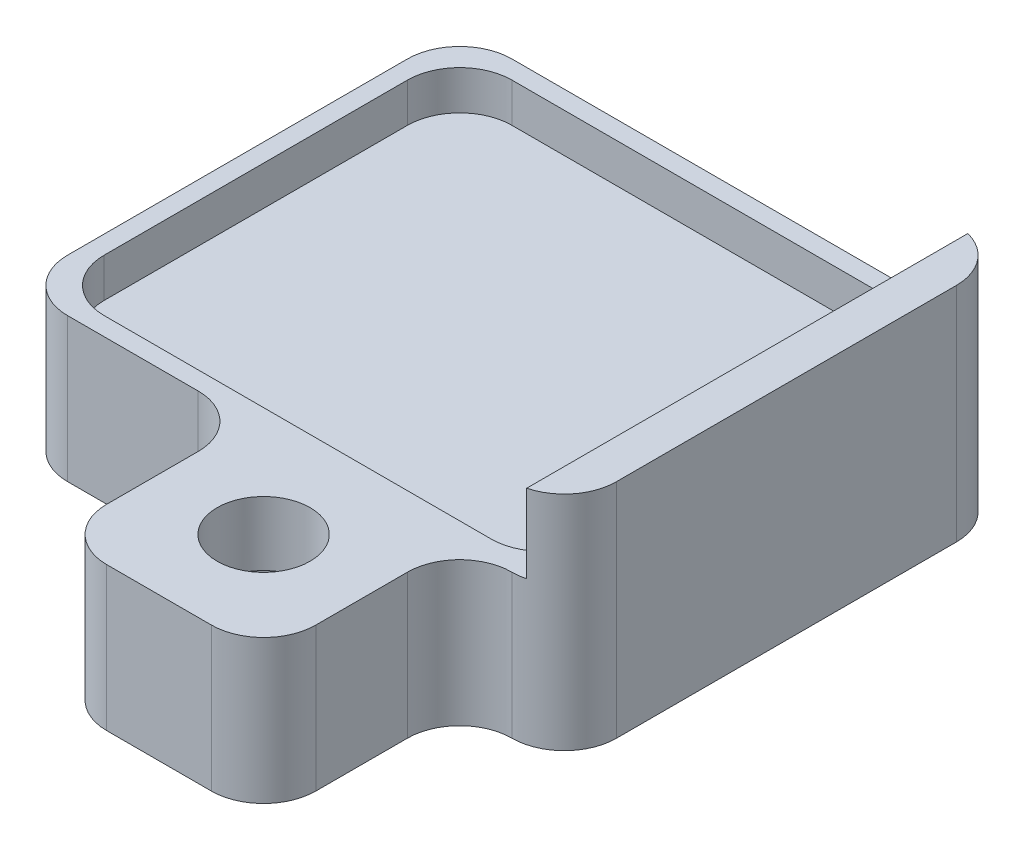
ISO-10303-21;
HEADER;
FILE_DESCRIPTION(('STEP AP214'),'2;1');
FILE_NAME('part.step','',(''),(''),'','','');
FILE_SCHEMA(('AUTOMOTIVE_DESIGN { 1 0 10303 214 1 1 1 1 }'));
ENDSEC;
DATA;
#1=APPLICATION_CONTEXT('core data for automotive mechanical design processes');
#2=APPLICATION_PROTOCOL_DEFINITION('international standard','automotive_design',2000,#1);
#3=PRODUCT_CONTEXT('',#1,'mechanical');
#4=PRODUCT('Part','Part','',(#3));
#5=PRODUCT_RELATED_PRODUCT_CATEGORY('part','',(#4));
#6=PRODUCT_DEFINITION_FORMATION('','',#4);
#7=PRODUCT_DEFINITION_CONTEXT('part definition',#1,'design');
#8=PRODUCT_DEFINITION('design','',#6,#7);
#9=PRODUCT_DEFINITION_SHAPE('','',#8);
#10=(LENGTH_UNIT() NAMED_UNIT(*) SI_UNIT(.MILLI.,.METRE.));
#11=(NAMED_UNIT(*) PLANE_ANGLE_UNIT() SI_UNIT($,.RADIAN.));
#12=(NAMED_UNIT(*) SI_UNIT($,.STERADIAN.) SOLID_ANGLE_UNIT());
#13=UNCERTAINTY_MEASURE_WITH_UNIT(LENGTH_MEASURE(1.E-05),#10,'distance_accuracy_value','');
#14=(GEOMETRIC_REPRESENTATION_CONTEXT(3) GLOBAL_UNCERTAINTY_ASSIGNED_CONTEXT((#13)) GLOBAL_UNIT_ASSIGNED_CONTEXT((#10,
#11,#12)) REPRESENTATION_CONTEXT('',''));
#15=CARTESIAN_POINT('',(0.,0.,0.));
#16=DIRECTION('',(0.,0.,1.));
#17=DIRECTION('',(1.,0.,0.));
#18=AXIS2_PLACEMENT_3D('',#15,#16,#17);
#19=CARTESIAN_POINT('',(-5.25,4.25,4.25));
#20=DIRECTION('',(0.,0.,-1.));
#21=DIRECTION('',(-1.,0.,0.));
#22=AXIS2_PLACEMENT_3D('',#19,#20,#21);
#23=PLANE('',#22);
#24=DIRECTION('',(1.,0.,0.));
#25=VECTOR('',#24,1.);
#26=CARTESIAN_POINT('',(-5.25,0.,4.25));
#27=LINE('',#26,#25);
#28=CARTESIAN_POINT('',(-4.25,0.,4.25));
#29=VERTEX_POINT('',#28);
#30=CARTESIAN_POINT('',(-1.75,0.,4.25));
#31=VERTEX_POINT('',#30);
#32=EDGE_CURVE('E380',#29,#31,#27,.T.);
#33=ORIENTED_EDGE('',*,*,#32,.T.);
#34=DIRECTION('',(0.,-1.,0.));
#35=VECTOR('',#34,1.);
#36=CARTESIAN_POINT('',(-1.75,2.75,4.25));
#37=LINE('',#36,#35);
#38=CARTESIAN_POINT('',(-1.75,2.75,4.25));
#39=VERTEX_POINT('',#38);
#40=EDGE_CURVE('E307',#31,#39,#37,.F.);
#41=ORIENTED_EDGE('',*,*,#40,.T.);
#42=DIRECTION('',(1.,0.,0.));
#43=VECTOR('',#42,1.);
#44=CARTESIAN_POINT('',(-5.25,2.75,4.25));
#45=LINE('',#44,#43);
#46=CARTESIAN_POINT('',(-4.25,2.75,4.25));
#47=VERTEX_POINT('',#46);
#48=EDGE_CURVE('E270',#47,#39,#45,.T.);
#49=ORIENTED_EDGE('',*,*,#48,.F.);
#50=DIRECTION('',(0.,-1.,0.));
#51=VECTOR('',#50,1.);
#52=CARTESIAN_POINT('',(-4.25,4.25,4.25));
#53=LINE('',#52,#51);
#54=EDGE_CURVE('E304',#47,#29,#53,.T.);
#55=ORIENTED_EDGE('',*,*,#54,.T.);
#56=EDGE_LOOP('',(#33,#41,#49,#55));
#57=FACE_BOUND('',#56,.T.);
#58=ADVANCED_FACE('F42',(#57),#23,.F.);
#59=CARTESIAN_POINT('',(-5.25,4.25,4.25));
#60=DIRECTION('',(1.,0.,0.));
#61=DIRECTION('',(0.,0.,-1.));
#62=AXIS2_PLACEMENT_3D('',#59,#60,#61);
#63=PLANE('',#62);
#64=DIRECTION('',(0.,0.,1.));
#65=VECTOR('',#64,1.);
#66=CARTESIAN_POINT('',(-5.25,2.75,-4.25));
#67=LINE('',#66,#65);
#68=CARTESIAN_POINT('',(-5.25,2.75,-3.25));
#69=VERTEX_POINT('',#68);
#70=CARTESIAN_POINT('',(-5.25,2.75,3.25));
#71=VERTEX_POINT('',#70);
#72=EDGE_CURVE('E364',#69,#71,#67,.T.);
#73=ORIENTED_EDGE('',*,*,#72,.F.);
#74=DIRECTION('',(0.,-1.,0.));
#75=VECTOR('',#74,1.);
#76=CARTESIAN_POINT('',(-5.25,4.25,-3.25));
#77=LINE('',#76,#75);
#78=CARTESIAN_POINT('',(-5.25,0.,-3.25));
#79=VERTEX_POINT('',#78);
#80=EDGE_CURVE('E301',#69,#79,#77,.T.);
#81=ORIENTED_EDGE('',*,*,#80,.T.);
#82=DIRECTION('',(0.,0.,1.));
#83=VECTOR('',#82,1.);
#84=CARTESIAN_POINT('',(-5.25,0.,4.25));
#85=LINE('',#84,#83);
#86=CARTESIAN_POINT('',(-5.25,0.,3.25));
#87=VERTEX_POINT('',#86);
#88=EDGE_CURVE('E385',#79,#87,#85,.T.);
#89=ORIENTED_EDGE('',*,*,#88,.T.);
#90=DIRECTION('',(0.,-1.,0.));
#91=VECTOR('',#90,1.);
#92=CARTESIAN_POINT('',(-5.25,4.25,3.25));
#93=LINE('',#92,#91);
#94=EDGE_CURVE('E299',#87,#71,#93,.F.);
#95=ORIENTED_EDGE('',*,*,#94,.T.);
#96=EDGE_LOOP('',(#73,#81,#89,#95));
#97=FACE_BOUND('',#96,.T.);
#98=ADVANCED_FACE('F487',(#97),#63,.F.);
#99=CARTESIAN_POINT('',(5.25,4.25,4.25));
#100=DIRECTION('',(-1.,0.,0.));
#101=DIRECTION('',(0.,0.,1.));
#102=AXIS2_PLACEMENT_3D('',#99,#100,#101);
#103=PLANE('',#102);
#104=DIRECTION('',(0.,0.,-1.));
#105=VECTOR('',#104,1.);
#106=CARTESIAN_POINT('',(5.25,0.,4.25));
#107=LINE('',#106,#105);
#108=CARTESIAN_POINT('',(5.25,0.,3.25));
#109=VERTEX_POINT('',#108);
#110=CARTESIAN_POINT('',(5.25,0.,-3.25));
#111=VERTEX_POINT('',#110);
#112=EDGE_CURVE('E233',#109,#111,#107,.T.);
#113=ORIENTED_EDGE('',*,*,#112,.T.);
#114=DIRECTION('',(0.,-1.,0.));
#115=VECTOR('',#114,1.);
#116=CARTESIAN_POINT('',(5.25,4.25,-3.25));
#117=LINE('',#116,#115);
#118=CARTESIAN_POINT('',(5.25,4.25,-3.25));
#119=VERTEX_POINT('',#118);
#120=EDGE_CURVE('E401',#111,#119,#117,.F.);
#121=ORIENTED_EDGE('',*,*,#120,.T.);
#122=DIRECTION('',(0.,0.,-1.));
#123=VECTOR('',#122,1.);
#124=CARTESIAN_POINT('',(5.25,4.25,4.25));
#125=LINE('',#124,#123);
#126=CARTESIAN_POINT('',(5.25,4.25,3.25));
#127=VERTEX_POINT('',#126);
#128=EDGE_CURVE('E244',#127,#119,#125,.T.);
#129=ORIENTED_EDGE('',*,*,#128,.F.);
#130=DIRECTION('',(0.,-1.,0.));
#131=VECTOR('',#130,1.);
#132=CARTESIAN_POINT('',(5.25,4.25,3.25));
#133=LINE('',#132,#131);
#134=EDGE_CURVE('E398',#127,#109,#133,.T.);
#135=ORIENTED_EDGE('',*,*,#134,.T.);
#136=EDGE_LOOP('',(#113,#121,#129,#135));
#137=FACE_BOUND('',#136,.T.);
#138=ADVANCED_FACE('F422',(#137),#103,.F.);
#139=CARTESIAN_POINT('',(-5.25,4.25,-4.25));
#140=DIRECTION('',(0.,0.,1.));
#141=DIRECTION('',(1.,0.,0.));
#142=AXIS2_PLACEMENT_3D('',#139,#140,#141);
#143=PLANE('',#142);
#144=DIRECTION('',(-1.,0.,0.));
#145=VECTOR('',#144,1.);
#146=CARTESIAN_POINT('',(-5.25,2.75,-4.25));
#147=LINE('',#146,#145);
#148=CARTESIAN_POINT('',(4.25,2.75,-4.25));
#149=VERTEX_POINT('',#148);
#150=CARTESIAN_POINT('',(-4.25,2.75,-4.25));
#151=VERTEX_POINT('',#150);
#152=EDGE_CURVE('E215',#149,#151,#147,.T.);
#153=ORIENTED_EDGE('',*,*,#152,.F.);
#154=DIRECTION('',(0.,-1.,0.));
#155=VECTOR('',#154,1.);
#156=CARTESIAN_POINT('',(4.25,4.25,-4.25));
#157=LINE('',#156,#155);
#158=CARTESIAN_POINT('',(4.25,0.,-4.25));
#159=VERTEX_POINT('',#158);
#160=EDGE_CURVE('E229',#149,#159,#157,.T.);
#161=ORIENTED_EDGE('',*,*,#160,.T.);
#162=DIRECTION('',(-1.,0.,0.));
#163=VECTOR('',#162,1.);
#164=CARTESIAN_POINT('',(-5.25,0.,-4.25));
#165=LINE('',#164,#163);
#166=CARTESIAN_POINT('',(-4.25,0.,-4.25));
#167=VERTEX_POINT('',#166);
#168=EDGE_CURVE('E383',#159,#167,#165,.T.);
#169=ORIENTED_EDGE('',*,*,#168,.T.);
#170=DIRECTION('',(0.,-1.,0.));
#171=VECTOR('',#170,1.);
#172=CARTESIAN_POINT('',(-4.25,4.25,-4.25));
#173=LINE('',#172,#171);
#174=EDGE_CURVE('E232',#167,#151,#173,.F.);
#175=ORIENTED_EDGE('',*,*,#174,.T.);
#176=EDGE_LOOP('',(#153,#161,#169,#175));
#177=FACE_BOUND('',#176,.T.);
#178=ADVANCED_FACE('F227',(#177),#143,.F.);
#179=CARTESIAN_POINT('',(5.25,4.25,-4.25));
#180=DIRECTION('',(0.,-1.,0.));
#181=DIRECTION('',(0.,0.,-1.));
#182=AXIS2_PLACEMENT_3D('',#179,#180,#181);
#183=PLANE('',#182);
#184=ORIENTED_EDGE('',*,*,#128,.T.);
#185=CARTESIAN_POINT('',(4.25,4.25,-3.25));
#186=DIRECTION('',(0.,-1.,0.));
#187=DIRECTION('',(0.,0.,-1.));
#188=AXIS2_PLACEMENT_3D('',#185,#186,#187);
#189=CIRCLE('',#188,1.);
#190=CARTESIAN_POINT('',(4.5,4.25,-4.21824583655185));
#191=VERTEX_POINT('',#190);
#192=EDGE_CURVE('E405',#119,#191,#189,.F.);
#193=ORIENTED_EDGE('',*,*,#192,.T.);
#194=DIRECTION('',(0.,0.,-1.));
#195=VECTOR('',#194,1.);
#196=CARTESIAN_POINT('',(4.5,4.25,-4.25));
#197=LINE('',#196,#195);
#198=CARTESIAN_POINT('',(4.5,4.25,4.21824583655185));
#199=VERTEX_POINT('',#198);
#200=EDGE_CURVE('E360',#199,#191,#197,.T.);
#201=ORIENTED_EDGE('',*,*,#200,.F.);
#202=CARTESIAN_POINT('',(4.25,4.25,3.25));
#203=DIRECTION('',(0.,-1.,0.));
#204=DIRECTION('',(0.,0.,-1.));
#205=AXIS2_PLACEMENT_3D('',#202,#203,#204);
#206=CIRCLE('',#205,1.);
#207=EDGE_CURVE('E403',#199,#127,#206,.F.);
#208=ORIENTED_EDGE('',*,*,#207,.T.);
#209=EDGE_LOOP('',(#184,#193,#201,#208));
#210=FACE_BOUND('',#209,.T.);
#211=ADVANCED_FACE('F417',(#210),#183,.F.);
#212=CARTESIAN_POINT('',(5.25,0.,-4.25));
#213=DIRECTION('',(0.,-1.,0.));
#214=DIRECTION('',(0.,0.,-1.));
#215=AXIS2_PLACEMENT_3D('',#212,#213,#214);
#216=PLANE('',#215);
#217=CARTESIAN_POINT('',(1.25,0.,6.));
#218=DIRECTION('',(0.,-1.,0.));
#219=DIRECTION('',(0.,0.,-1.));
#220=AXIS2_PLACEMENT_3D('',#217,#218,#219);
#221=CIRCLE('',#220,1.5875);
#222=CARTESIAN_POINT('',(1.25,0.,4.4125));
#223=VERTEX_POINT('',#222);
#224=EDGE_CURVE('E752',#223,#223,#221,.T.);
#225=ORIENTED_EDGE('',*,*,#224,.F.);
#226=EDGE_LOOP('',(#225));
#227=FACE_BOUND('',#226,.T.);
#228=ORIENTED_EDGE('',*,*,#168,.F.);
#229=CARTESIAN_POINT('',(4.25,0.,-3.25));
#230=DIRECTION('',(0.,-1.,0.));
#231=DIRECTION('',(0.,0.,-1.));
#232=AXIS2_PLACEMENT_3D('',#229,#230,#231);
#233=CIRCLE('',#232,1.);
#234=EDGE_CURVE('E239',#159,#111,#233,.T.);
#235=ORIENTED_EDGE('',*,*,#234,.T.);
#236=ORIENTED_EDGE('',*,*,#112,.F.);
#237=CARTESIAN_POINT('',(4.25,0.,3.25));
#238=DIRECTION('',(0.,-1.,0.));
#239=DIRECTION('',(0.,0.,-1.));
#240=AXIS2_PLACEMENT_3D('',#237,#238,#239);
#241=CIRCLE('',#240,1.);
#242=CARTESIAN_POINT('',(4.25,0.,4.25));
#243=VERTEX_POINT('',#242);
#244=EDGE_CURVE('E395',#109,#243,#241,.T.);
#245=ORIENTED_EDGE('',*,*,#244,.T.);
#246=CARTESIAN_POINT('',(4.25,0.,5.25));
#247=DIRECTION('',(0.,-1.,0.));
#248=DIRECTION('',(0.,0.,-1.));
#249=AXIS2_PLACEMENT_3D('',#246,#247,#248);
#250=CIRCLE('',#249,1.);
#251=CARTESIAN_POINT('',(3.25,0.,5.25));
#252=VERTEX_POINT('',#251);
#253=EDGE_CURVE('E332',#243,#252,#250,.F.);
#254=ORIENTED_EDGE('',*,*,#253,.T.);
#255=DIRECTION('',(0.,0.,-1.));
#256=VECTOR('',#255,1.);
#257=CARTESIAN_POINT('',(3.25,0.,8.));
#258=LINE('',#257,#256);
#259=CARTESIAN_POINT('',(3.25,0.,7.));
#260=VERTEX_POINT('',#259);
#261=EDGE_CURVE('E248',#260,#252,#258,.T.);
#262=ORIENTED_EDGE('',*,*,#261,.F.);
#263=CARTESIAN_POINT('',(2.25,0.,7.));
#264=DIRECTION('',(0.,-1.,0.));
#265=DIRECTION('',(0.,0.,-1.));
#266=AXIS2_PLACEMENT_3D('',#263,#264,#265);
#267=CIRCLE('',#266,1.);
#268=CARTESIAN_POINT('',(2.25,0.,8.));
#269=VERTEX_POINT('',#268);
#270=EDGE_CURVE('E393',#260,#269,#267,.T.);
#271=ORIENTED_EDGE('',*,*,#270,.T.);
#272=DIRECTION('',(1.,0.,0.));
#273=VECTOR('',#272,1.);
#274=CARTESIAN_POINT('',(-0.749999999999999,0.,8.));
#275=LINE('',#274,#273);
#276=CARTESIAN_POINT('',(0.250000000000001,0.,8.));
#277=VERTEX_POINT('',#276);
#278=EDGE_CURVE('E453',#277,#269,#275,.T.);
#279=ORIENTED_EDGE('',*,*,#278,.F.);
#280=CARTESIAN_POINT('',(0.250000000000001,0.,7.));
#281=DIRECTION('',(0.,-1.,0.));
#282=DIRECTION('',(0.,0.,-1.));
#283=AXIS2_PLACEMENT_3D('',#280,#281,#282);
#284=CIRCLE('',#283,1.);
#285=CARTESIAN_POINT('',(-0.749999999999999,0.,7.));
#286=VERTEX_POINT('',#285);
#287=EDGE_CURVE('E391',#277,#286,#284,.T.);
#288=ORIENTED_EDGE('',*,*,#287,.T.);
#289=DIRECTION('',(0.,0.,-1.));
#290=VECTOR('',#289,1.);
#291=CARTESIAN_POINT('',(-0.749999999999999,0.,8.));
#292=LINE('',#291,#290);
#293=CARTESIAN_POINT('',(-0.749999999999999,0.,5.25));
#294=VERTEX_POINT('',#293);
#295=EDGE_CURVE('E252',#286,#294,#292,.T.);
#296=ORIENTED_EDGE('',*,*,#295,.T.);
#297=CARTESIAN_POINT('',(-1.75,0.,5.25));
#298=DIRECTION('',(0.,-1.,0.));
#299=DIRECTION('',(0.,0.,-1.));
#300=AXIS2_PLACEMENT_3D('',#297,#298,#299);
#301=CIRCLE('',#300,1.);
#302=EDGE_CURVE('E334',#294,#31,#301,.F.);
#303=ORIENTED_EDGE('',*,*,#302,.T.);
#304=ORIENTED_EDGE('',*,*,#32,.F.);
#305=CARTESIAN_POINT('',(-4.25,0.,3.25));
#306=DIRECTION('',(0.,-1.,0.));
#307=DIRECTION('',(0.,0.,-1.));
#308=AXIS2_PLACEMENT_3D('',#305,#306,#307);
#309=CIRCLE('',#308,1.);
#310=EDGE_CURVE('E240',#29,#87,#309,.T.);
#311=ORIENTED_EDGE('',*,*,#310,.T.);
#312=ORIENTED_EDGE('',*,*,#88,.F.);
#313=CARTESIAN_POINT('',(-4.25,0.,-3.25));
#314=DIRECTION('',(0.,-1.,0.));
#315=DIRECTION('',(0.,0.,-1.));
#316=AXIS2_PLACEMENT_3D('',#313,#314,#315);
#317=CIRCLE('',#316,1.);
#318=EDGE_CURVE('E242',#79,#167,#317,.T.);
#319=ORIENTED_EDGE('',*,*,#318,.T.);
#320=EDGE_LOOP('',(#228,#235,#236,#245,#254,#262,#271,#279,#288,#296,#303,#304,#311,#312,#319));
#321=FACE_BOUND('',#320,.T.);
#322=ADVANCED_FACE('F432',(#227,#321),#216,.T.);
#323=CARTESIAN_POINT('',(4.5,2.75,-4.25));
#324=DIRECTION('',(1.,0.,0.));
#325=DIRECTION('',(0.,0.,-1.));
#326=AXIS2_PLACEMENT_3D('',#323,#324,#325);
#327=PLANE('',#326);
#328=ORIENTED_EDGE('',*,*,#200,.T.);
#329=DIRECTION('',(0.,-1.,0.));
#330=VECTOR('',#329,1.);
#331=CARTESIAN_POINT('',(4.5,4.25,-4.21824583655185));
#332=LINE('',#331,#330);
#333=CARTESIAN_POINT('',(4.5,2.75,-4.21824583655185));
#334=VERTEX_POINT('',#333);
#335=EDGE_CURVE('E278',#191,#334,#332,.T.);
#336=ORIENTED_EDGE('',*,*,#335,.T.);
#337=DIRECTION('',(0.,0.,-1.));
#338=VECTOR('',#337,1.);
#339=CARTESIAN_POINT('',(4.5,2.75,-4.25));
#340=LINE('',#339,#338);
#341=CARTESIAN_POINT('',(4.5,2.75,-2.9));
#342=VERTEX_POINT('',#341);
#343=EDGE_CURVE('E218',#342,#334,#340,.T.);
#344=ORIENTED_EDGE('',*,*,#343,.F.);
#345=DIRECTION('',(0.,1.,0.));
#346=VECTOR('',#345,1.);
#347=CARTESIAN_POINT('',(4.5,2.,-2.9));
#348=LINE('',#347,#346);
#349=CARTESIAN_POINT('',(4.5,2.,-2.9));
#350=VERTEX_POINT('',#349);
#351=EDGE_CURVE('E410',#342,#350,#348,.F.);
#352=ORIENTED_EDGE('',*,*,#351,.T.);
#353=DIRECTION('',(0.,0.,-1.));
#354=VECTOR('',#353,1.);
#355=CARTESIAN_POINT('',(4.5,2.,3.9));
#356=LINE('',#355,#354);
#357=CARTESIAN_POINT('',(4.5,2.,2.9));
#358=VERTEX_POINT('',#357);
#359=EDGE_CURVE('E373',#358,#350,#356,.T.);
#360=ORIENTED_EDGE('',*,*,#359,.F.);
#361=DIRECTION('',(0.,1.,0.));
#362=VECTOR('',#361,1.);
#363=CARTESIAN_POINT('',(4.5,2.75,2.9));
#364=LINE('',#363,#362);
#365=CARTESIAN_POINT('',(4.5,2.75,2.9));
#366=VERTEX_POINT('',#365);
#367=EDGE_CURVE('E407',#358,#366,#364,.T.);
#368=ORIENTED_EDGE('',*,*,#367,.T.);
#369=CARTESIAN_POINT('',(4.5,2.75,4.21824583655185));
#370=VERTEX_POINT('',#369);
#371=EDGE_CURVE('E234',#370,#366,#340,.T.);
#372=ORIENTED_EDGE('',*,*,#371,.F.);
#373=DIRECTION('',(0.,-1.,0.));
#374=VECTOR('',#373,1.);
#375=CARTESIAN_POINT('',(4.5,2.75,4.21824583655185));
#376=LINE('',#375,#374);
#377=EDGE_CURVE('E412',#370,#199,#376,.F.);
#378=ORIENTED_EDGE('',*,*,#377,.T.);
#379=EDGE_LOOP('',(#328,#336,#344,#352,#360,#368,#372,#378));
#380=FACE_BOUND('',#379,.T.);
#381=ADVANCED_FACE('F414',(#380),#327,.F.);
#382=CARTESIAN_POINT('',(-5.25,2.75,4.25));
#383=DIRECTION('',(0.,1.,0.));
#384=DIRECTION('',(0.,0.,1.));
#385=AXIS2_PLACEMENT_3D('',#382,#383,#384);
#386=PLANE('',#385);
#387=CARTESIAN_POINT('',(1.25,2.75,6.));
#388=DIRECTION('',(0.,1.,0.));
#389=DIRECTION('',(0.,0.,1.));
#390=AXIS2_PLACEMENT_3D('',#387,#388,#389);
#391=CIRCLE('',#390,0.888999999999999);
#392=CARTESIAN_POINT('',(1.25,2.75,6.889));
#393=VERTEX_POINT('',#392);
#394=EDGE_CURVE('E263',#393,#393,#391,.T.);
#395=ORIENTED_EDGE('',*,*,#394,.F.);
#396=EDGE_LOOP('',(#395));
#397=FACE_BOUND('',#396,.T.);
#398=ORIENTED_EDGE('',*,*,#343,.T.);
#399=CARTESIAN_POINT('',(4.25,2.75,-3.25));
#400=DIRECTION('',(0.,1.,0.));
#401=DIRECTION('',(0.,0.,1.));
#402=AXIS2_PLACEMENT_3D('',#399,#400,#401);
#403=CIRCLE('',#402,1.);
#404=EDGE_CURVE('E212',#334,#149,#403,.T.);
#405=ORIENTED_EDGE('',*,*,#404,.T.);
#406=ORIENTED_EDGE('',*,*,#152,.T.);
#407=CARTESIAN_POINT('',(-4.25,2.75,-3.25));
#408=DIRECTION('',(0.,1.,0.));
#409=DIRECTION('',(0.,0.,1.));
#410=AXIS2_PLACEMENT_3D('',#407,#408,#409);
#411=CIRCLE('',#410,1.);
#412=EDGE_CURVE('E277',#151,#69,#411,.T.);
#413=ORIENTED_EDGE('',*,*,#412,.T.);
#414=ORIENTED_EDGE('',*,*,#72,.T.);
#415=CARTESIAN_POINT('',(-4.25,2.75,3.25));
#416=DIRECTION('',(0.,1.,0.));
#417=DIRECTION('',(0.,0.,1.));
#418=AXIS2_PLACEMENT_3D('',#415,#416,#417);
#419=CIRCLE('',#418,1.);
#420=EDGE_CURVE('E275',#71,#47,#419,.T.);
#421=ORIENTED_EDGE('',*,*,#420,.T.);
#422=ORIENTED_EDGE('',*,*,#48,.T.);
#423=CARTESIAN_POINT('',(-1.75,2.75,5.25));
#424=DIRECTION('',(0.,1.,0.));
#425=DIRECTION('',(0.,0.,1.));
#426=AXIS2_PLACEMENT_3D('',#423,#424,#425);
#427=CIRCLE('',#426,1.);
#428=CARTESIAN_POINT('',(-0.749999999999999,2.75,5.25));
#429=VERTEX_POINT('',#428);
#430=EDGE_CURVE('E336',#39,#429,#427,.F.);
#431=ORIENTED_EDGE('',*,*,#430,.T.);
#432=DIRECTION('',(0.,0.,-1.));
#433=VECTOR('',#432,1.);
#434=CARTESIAN_POINT('',(-0.749999999999999,2.75,8.));
#435=LINE('',#434,#433);
#436=CARTESIAN_POINT('',(-0.749999999999999,2.75,7.));
#437=VERTEX_POINT('',#436);
#438=EDGE_CURVE('E265',#437,#429,#435,.T.);
#439=ORIENTED_EDGE('',*,*,#438,.F.);
#440=CARTESIAN_POINT('',(0.250000000000001,2.75,7.));
#441=DIRECTION('',(0.,1.,0.));
#442=DIRECTION('',(0.,0.,1.));
#443=AXIS2_PLACEMENT_3D('',#440,#441,#442);
#444=CIRCLE('',#443,1.);
#445=CARTESIAN_POINT('',(0.250000000000001,2.75,8.));
#446=VERTEX_POINT('',#445);
#447=EDGE_CURVE('E280',#437,#446,#444,.T.);
#448=ORIENTED_EDGE('',*,*,#447,.T.);
#449=DIRECTION('',(-1.,0.,0.));
#450=VECTOR('',#449,1.);
#451=CARTESIAN_POINT('',(-0.749999999999999,2.75,8.));
#452=LINE('',#451,#450);
#453=CARTESIAN_POINT('',(2.25,2.75,8.));
#454=VERTEX_POINT('',#453);
#455=EDGE_CURVE('E269',#454,#446,#452,.T.);
#456=ORIENTED_EDGE('',*,*,#455,.F.);
#457=CARTESIAN_POINT('',(2.25,2.75,7.));
#458=DIRECTION('',(0.,1.,0.));
#459=DIRECTION('',(0.,0.,1.));
#460=AXIS2_PLACEMENT_3D('',#457,#458,#459);
#461=CIRCLE('',#460,1.);
#462=CARTESIAN_POINT('',(3.25,2.75,7.));
#463=VERTEX_POINT('',#462);
#464=EDGE_CURVE('E282',#454,#463,#461,.T.);
#465=ORIENTED_EDGE('',*,*,#464,.T.);
#466=DIRECTION('',(0.,0.,-1.));
#467=VECTOR('',#466,1.);
#468=CARTESIAN_POINT('',(3.25,2.75,8.));
#469=LINE('',#468,#467);
#470=CARTESIAN_POINT('',(3.25,2.75,5.25));
#471=VERTEX_POINT('',#470);
#472=EDGE_CURVE('E253',#463,#471,#469,.T.);
#473=ORIENTED_EDGE('',*,*,#472,.T.);
#474=CARTESIAN_POINT('',(4.25,2.75,5.25));
#475=DIRECTION('',(0.,1.,0.));
#476=DIRECTION('',(0.,0.,1.));
#477=AXIS2_PLACEMENT_3D('',#474,#475,#476);
#478=CIRCLE('',#477,1.);
#479=CARTESIAN_POINT('',(4.25,2.75,4.25));
#480=VERTEX_POINT('',#479);
#481=EDGE_CURVE('E330',#471,#480,#478,.F.);
#482=ORIENTED_EDGE('',*,*,#481,.T.);
#483=CARTESIAN_POINT('',(4.25,2.75,3.25));
#484=DIRECTION('',(0.,1.,0.));
#485=DIRECTION('',(0.,0.,1.));
#486=AXIS2_PLACEMENT_3D('',#483,#484,#485);
#487=CIRCLE('',#486,1.);
#488=EDGE_CURVE('E223',#480,#370,#487,.T.);
#489=ORIENTED_EDGE('',*,*,#488,.T.);
#490=ORIENTED_EDGE('',*,*,#371,.T.);
#491=CARTESIAN_POINT('',(3.5,2.75,2.9));
#492=DIRECTION('',(0.,1.,0.));
#493=DIRECTION('',(0.,0.,1.));
#494=AXIS2_PLACEMENT_3D('',#491,#492,#493);
#495=CIRCLE('',#494,1.);
#496=CARTESIAN_POINT('',(3.5,2.75,3.9));
#497=VERTEX_POINT('',#496);
#498=EDGE_CURVE('E13',#366,#497,#495,.F.);
#499=ORIENTED_EDGE('',*,*,#498,.T.);
#500=DIRECTION('',(1.,0.,0.));
#501=VECTOR('',#500,1.);
#502=CARTESIAN_POINT('',(-4.9,2.75,3.9));
#503=LINE('',#502,#501);
#504=CARTESIAN_POINT('',(-3.9,2.75,3.9));
#505=VERTEX_POINT('',#504);
#506=EDGE_CURVE('E346',#505,#497,#503,.T.);
#507=ORIENTED_EDGE('',*,*,#506,.F.);
#508=CARTESIAN_POINT('',(-3.9,2.75,2.9));
#509=DIRECTION('',(0.,1.,0.));
#510=DIRECTION('',(0.,0.,1.));
#511=AXIS2_PLACEMENT_3D('',#508,#509,#510);
#512=CIRCLE('',#511,1.);
#513=CARTESIAN_POINT('',(-4.9,2.75,2.9));
#514=VERTEX_POINT('',#513);
#515=EDGE_CURVE('E51',#505,#514,#512,.F.);
#516=ORIENTED_EDGE('',*,*,#515,.T.);
#517=DIRECTION('',(0.,0.,1.));
#518=VECTOR('',#517,1.);
#519=CARTESIAN_POINT('',(-4.9,2.75,3.9));
#520=LINE('',#519,#518);
#521=CARTESIAN_POINT('',(-4.9,2.75,-2.9));
#522=VERTEX_POINT('',#521);
#523=EDGE_CURVE('E345',#522,#514,#520,.T.);
#524=ORIENTED_EDGE('',*,*,#523,.F.);
#525=CARTESIAN_POINT('',(-3.9,2.75,-2.9));
#526=DIRECTION('',(0.,1.,0.));
#527=DIRECTION('',(0.,0.,1.));
#528=AXIS2_PLACEMENT_3D('',#525,#526,#527);
#529=CIRCLE('',#528,1.);
#530=CARTESIAN_POINT('',(-3.9,2.75,-3.9));
#531=VERTEX_POINT('',#530);
#532=EDGE_CURVE('E340',#522,#531,#529,.F.);
#533=ORIENTED_EDGE('',*,*,#532,.T.);
#534=DIRECTION('',(-1.,0.,0.));
#535=VECTOR('',#534,1.);
#536=CARTESIAN_POINT('',(-4.9,2.75,-3.9));
#537=LINE('',#536,#535);
#538=CARTESIAN_POINT('',(3.5,2.75,-3.9));
#539=VERTEX_POINT('',#538);
#540=EDGE_CURVE('E354',#539,#531,#537,.T.);
#541=ORIENTED_EDGE('',*,*,#540,.F.);
#542=CARTESIAN_POINT('',(3.5,2.75,-2.9));
#543=DIRECTION('',(0.,1.,0.));
#544=DIRECTION('',(0.,0.,1.));
#545=AXIS2_PLACEMENT_3D('',#542,#543,#544);
#546=CIRCLE('',#545,1.);
#547=EDGE_CURVE('E338',#539,#342,#546,.F.);
#548=ORIENTED_EDGE('',*,*,#547,.T.);
#549=EDGE_LOOP('',(#398,#405,#406,#413,#414,#421,#422,#431,#439,#448,#456,#465,#473,#482,#489,
#490,#499,#507,#516,#524,#533,#541,#548));
#550=FACE_BOUND('',#549,.T.);
#551=ADVANCED_FACE('F214',(#397,#550),#386,.T.);
#552=CARTESIAN_POINT('',(-4.9,2.,3.9));
#553=DIRECTION('',(0.,0.,1.));
#554=DIRECTION('',(1.,0.,0.));
#555=AXIS2_PLACEMENT_3D('',#552,#553,#554);
#556=PLANE('',#555);
#557=DIRECTION('',(1.,0.,0.));
#558=VECTOR('',#557,1.);
#559=CARTESIAN_POINT('',(-4.9,2.,3.9));
#560=LINE('',#559,#558);
#561=CARTESIAN_POINT('',(-3.9,2.,3.9));
#562=VERTEX_POINT('',#561);
#563=CARTESIAN_POINT('',(3.5,2.,3.9));
#564=VERTEX_POINT('',#563);
#565=EDGE_CURVE('E358',#562,#564,#560,.T.);
#566=ORIENTED_EDGE('',*,*,#565,.F.);
#567=DIRECTION('',(0.,1.,0.));
#568=VECTOR('',#567,1.);
#569=CARTESIAN_POINT('',(-3.9,2.75,3.9));
#570=LINE('',#569,#568);
#571=EDGE_CURVE('E327',#562,#505,#570,.T.);
#572=ORIENTED_EDGE('',*,*,#571,.T.);
#573=ORIENTED_EDGE('',*,*,#506,.T.);
#574=DIRECTION('',(0.,1.,0.));
#575=VECTOR('',#574,1.);
#576=CARTESIAN_POINT('',(3.5,2.,3.9));
#577=LINE('',#576,#575);
#578=EDGE_CURVE('E58',#497,#564,#577,.F.);
#579=ORIENTED_EDGE('',*,*,#578,.T.);
#580=EDGE_LOOP('',(#566,#572,#573,#579));
#581=FACE_BOUND('',#580,.T.);
#582=ADVANCED_FACE('F357',(#581),#556,.F.);
#583=CARTESIAN_POINT('',(-4.9,2.,3.9));
#584=DIRECTION('',(-1.,0.,0.));
#585=DIRECTION('',(0.,0.,1.));
#586=AXIS2_PLACEMENT_3D('',#583,#584,#585);
#587=PLANE('',#586);
#588=DIRECTION('',(0.,0.,1.));
#589=VECTOR('',#588,1.);
#590=CARTESIAN_POINT('',(-4.9,2.,3.9));
#591=LINE('',#590,#589);
#592=CARTESIAN_POINT('',(-4.9,2.,-2.9));
#593=VERTEX_POINT('',#592);
#594=CARTESIAN_POINT('',(-4.9,2.,2.9));
#595=VERTEX_POINT('',#594);
#596=EDGE_CURVE('E361',#593,#595,#591,.T.);
#597=ORIENTED_EDGE('',*,*,#596,.F.);
#598=DIRECTION('',(0.,1.,0.));
#599=VECTOR('',#598,1.);
#600=CARTESIAN_POINT('',(-4.9,2.75,-2.9));
#601=LINE('',#600,#599);
#602=EDGE_CURVE('E323',#593,#522,#601,.T.);
#603=ORIENTED_EDGE('',*,*,#602,.T.);
#604=ORIENTED_EDGE('',*,*,#523,.T.);
#605=DIRECTION('',(0.,1.,0.));
#606=VECTOR('',#605,1.);
#607=CARTESIAN_POINT('',(-4.9,2.,2.9));
#608=LINE('',#607,#606);
#609=EDGE_CURVE('E321',#514,#595,#608,.F.);
#610=ORIENTED_EDGE('',*,*,#609,.T.);
#611=EDGE_LOOP('',(#597,#603,#604,#610));
#612=FACE_BOUND('',#611,.T.);
#613=ADVANCED_FACE('F352',(#612),#587,.F.);
#614=CARTESIAN_POINT('',(-4.9,2.,-3.9));
#615=DIRECTION('',(0.,0.,-1.));
#616=DIRECTION('',(-1.,0.,0.));
#617=AXIS2_PLACEMENT_3D('',#614,#615,#616);
#618=PLANE('',#617);
#619=DIRECTION('',(-1.,0.,0.));
#620=VECTOR('',#619,1.);
#621=CARTESIAN_POINT('',(-4.9,2.,-3.9));
#622=LINE('',#621,#620);
#623=CARTESIAN_POINT('',(3.5,2.,-3.9));
#624=VERTEX_POINT('',#623);
#625=CARTESIAN_POINT('',(-3.9,2.,-3.9));
#626=VERTEX_POINT('',#625);
#627=EDGE_CURVE('E366',#624,#626,#622,.T.);
#628=ORIENTED_EDGE('',*,*,#627,.F.);
#629=DIRECTION('',(0.,1.,0.));
#630=VECTOR('',#629,1.);
#631=CARTESIAN_POINT('',(3.5,2.75,-3.9));
#632=LINE('',#631,#630);
#633=EDGE_CURVE('E311',#624,#539,#632,.T.);
#634=ORIENTED_EDGE('',*,*,#633,.T.);
#635=ORIENTED_EDGE('',*,*,#540,.T.);
#636=DIRECTION('',(0.,1.,0.));
#637=VECTOR('',#636,1.);
#638=CARTESIAN_POINT('',(-3.9,2.,-3.9));
#639=LINE('',#638,#637);
#640=EDGE_CURVE('E309',#531,#626,#639,.F.);
#641=ORIENTED_EDGE('',*,*,#640,.T.);
#642=EDGE_LOOP('',(#628,#634,#635,#641));
#643=FACE_BOUND('',#642,.T.);
#644=ADVANCED_FACE('F473',(#643),#618,.F.);
#645=CARTESIAN_POINT('',(4.5,2.,-3.9));
#646=DIRECTION('',(0.,-1.,0.));
#647=DIRECTION('',(0.,0.,-1.));
#648=AXIS2_PLACEMENT_3D('',#645,#646,#647);
#649=PLANE('',#648);
#650=ORIENTED_EDGE('',*,*,#359,.T.);
#651=CARTESIAN_POINT('',(3.5,2.,-2.9));
#652=DIRECTION('',(0.,-1.,0.));
#653=DIRECTION('',(0.,0.,-1.));
#654=AXIS2_PLACEMENT_3D('',#651,#652,#653);
#655=CIRCLE('',#654,1.);
#656=EDGE_CURVE('E319',#350,#624,#655,.F.);
#657=ORIENTED_EDGE('',*,*,#656,.T.);
#658=ORIENTED_EDGE('',*,*,#627,.T.);
#659=CARTESIAN_POINT('',(-3.9,2.,-2.9));
#660=DIRECTION('',(0.,-1.,0.));
#661=DIRECTION('',(0.,0.,-1.));
#662=AXIS2_PLACEMENT_3D('',#659,#660,#661);
#663=CIRCLE('',#662,1.);
#664=EDGE_CURVE('E317',#626,#593,#663,.F.);
#665=ORIENTED_EDGE('',*,*,#664,.T.);
#666=ORIENTED_EDGE('',*,*,#596,.T.);
#667=CARTESIAN_POINT('',(-3.9,2.,2.9));
#668=DIRECTION('',(0.,-1.,0.));
#669=DIRECTION('',(0.,0.,-1.));
#670=AXIS2_PLACEMENT_3D('',#667,#668,#669);
#671=CIRCLE('',#670,1.);
#672=EDGE_CURVE('E65',#595,#562,#671,.F.);
#673=ORIENTED_EDGE('',*,*,#672,.T.);
#674=ORIENTED_EDGE('',*,*,#565,.T.);
#675=CARTESIAN_POINT('',(3.5,2.,2.9));
#676=DIRECTION('',(0.,-1.,0.));
#677=DIRECTION('',(0.,0.,-1.));
#678=AXIS2_PLACEMENT_3D('',#675,#676,#677);
#679=CIRCLE('',#678,1.);
#680=EDGE_CURVE('E314',#564,#358,#679,.F.);
#681=ORIENTED_EDGE('',*,*,#680,.T.);
#682=EDGE_LOOP('',(#650,#657,#658,#665,#666,#673,#674,#681));
#683=FACE_BOUND('',#682,.T.);
#684=ADVANCED_FACE('F465',(#683),#649,.F.);
#685=CARTESIAN_POINT('',(-0.749999999999999,2.75,8.));
#686=DIRECTION('',(1.,0.,0.));
#687=DIRECTION('',(0.,1.,0.));
#688=AXIS2_PLACEMENT_3D('',#685,#686,#687);
#689=PLANE('',#688);
#690=ORIENTED_EDGE('',*,*,#295,.F.);
#691=DIRECTION('',(0.,-1.,0.));
#692=VECTOR('',#691,1.);
#693=CARTESIAN_POINT('',(-0.749999999999999,2.75,7.));
#694=LINE('',#693,#692);
#695=EDGE_CURVE('E297',#286,#437,#694,.F.);
#696=ORIENTED_EDGE('',*,*,#695,.T.);
#697=ORIENTED_EDGE('',*,*,#438,.T.);
#698=DIRECTION('',(0.,-1.,0.));
#699=VECTOR('',#698,1.);
#700=CARTESIAN_POINT('',(-0.749999999999999,0.,5.25));
#701=LINE('',#700,#699);
#702=EDGE_CURVE('E294',#429,#294,#701,.T.);
#703=ORIENTED_EDGE('',*,*,#702,.T.);
#704=EDGE_LOOP('',(#690,#696,#697,#703));
#705=FACE_BOUND('',#704,.T.);
#706=ADVANCED_FACE('F631',(#705),#689,.F.);
#707=CARTESIAN_POINT('',(3.25,2.75,8.));
#708=DIRECTION('',(-1.,0.,0.));
#709=DIRECTION('',(0.,-1.,0.));
#710=AXIS2_PLACEMENT_3D('',#707,#708,#709);
#711=PLANE('',#710);
#712=ORIENTED_EDGE('',*,*,#261,.T.);
#713=DIRECTION('',(0.,1.,0.));
#714=VECTOR('',#713,1.);
#715=CARTESIAN_POINT('',(3.25,2.75,5.25));
#716=LINE('',#715,#714);
#717=EDGE_CURVE('E286',#252,#471,#716,.T.);
#718=ORIENTED_EDGE('',*,*,#717,.T.);
#719=ORIENTED_EDGE('',*,*,#472,.F.);
#720=DIRECTION('',(0.,1.,0.));
#721=VECTOR('',#720,1.);
#722=CARTESIAN_POINT('',(3.25,0.,7.));
#723=LINE('',#722,#721);
#724=EDGE_CURVE('E222',#463,#260,#723,.F.);
#725=ORIENTED_EDGE('',*,*,#724,.T.);
#726=EDGE_LOOP('',(#712,#718,#719,#725));
#727=FACE_BOUND('',#726,.T.);
#728=ADVANCED_FACE('F440',(#727),#711,.F.);
#729=CARTESIAN_POINT('',(-0.749999999999999,0.,8.));
#730=DIRECTION('',(0.,0.,1.));
#731=DIRECTION('',(1.,0.,0.));
#732=AXIS2_PLACEMENT_3D('',#729,#730,#731);
#733=PLANE('',#732);
#734=ORIENTED_EDGE('',*,*,#278,.T.);
#735=DIRECTION('',(0.,1.,0.));
#736=VECTOR('',#735,1.);
#737=CARTESIAN_POINT('',(2.25,2.75,8.));
#738=LINE('',#737,#736);
#739=EDGE_CURVE('E291',#269,#454,#738,.T.);
#740=ORIENTED_EDGE('',*,*,#739,.T.);
#741=ORIENTED_EDGE('',*,*,#455,.T.);
#742=DIRECTION('',(0.,-1.,0.));
#743=VECTOR('',#742,1.);
#744=CARTESIAN_POINT('',(0.250000000000001,0.,8.));
#745=LINE('',#744,#743);
#746=EDGE_CURVE('E288',#446,#277,#745,.T.);
#747=ORIENTED_EDGE('',*,*,#746,.T.);
#748=EDGE_LOOP('',(#734,#740,#741,#747));
#749=FACE_BOUND('',#748,.T.);
#750=ADVANCED_FACE('F450',(#749),#733,.T.);
#751=CARTESIAN_POINT('',(1.25,0.,6.));
#752=DIRECTION('',(0.,-1.,0.));
#753=DIRECTION('',(0.,0.,-1.));
#754=AXIS2_PLACEMENT_3D('',#751,#752,#753);
#755=CYLINDRICAL_SURFACE('',#754,0.888999999999999);
#756=ORIENTED_EDGE('',*,*,#394,.T.);
#757=EDGE_LOOP('',(#756));
#758=FACE_BOUND('',#757,.T.);
#759=CARTESIAN_POINT('',(1.25,1.524,6.));
#760=DIRECTION('',(0.,-1.,0.));
#761=DIRECTION('',(0.,0.,-1.));
#762=AXIS2_PLACEMENT_3D('',#759,#760,#761);
#763=CIRCLE('',#762,0.889);
#764=CARTESIAN_POINT('',(1.25,1.524,5.111));
#765=VERTEX_POINT('',#764);
#766=EDGE_CURVE('E457',#765,#765,#763,.T.);
#767=ORIENTED_EDGE('',*,*,#766,.T.);
#768=EDGE_LOOP('',(#767));
#769=FACE_BOUND('',#768,.T.);
#770=ADVANCED_FACE('F608',(#758,#769),#755,.F.);
#771=CARTESIAN_POINT('',(2.139,1.524,6.));
#772=DIRECTION('',(0.,1.,0.));
#773=DIRECTION('',(0.,0.,1.));
#774=AXIS2_PLACEMENT_3D('',#771,#772,#773);
#775=PLANE('',#774);
#776=ORIENTED_EDGE('',*,*,#766,.F.);
#777=EDGE_LOOP('',(#776));
#778=FACE_BOUND('',#777,.T.);
#779=CARTESIAN_POINT('',(1.25,1.524,6.));
#780=DIRECTION('',(0.,-1.,0.));
#781=DIRECTION('',(0.,0.,-1.));
#782=AXIS2_PLACEMENT_3D('',#779,#780,#781);
#783=CIRCLE('',#782,1.5875);
#784=CARTESIAN_POINT('',(1.25,1.524,4.4125));
#785=VERTEX_POINT('',#784);
#786=EDGE_CURVE('E754',#785,#785,#783,.T.);
#787=ORIENTED_EDGE('',*,*,#786,.T.);
#788=EDGE_LOOP('',(#787));
#789=FACE_BOUND('',#788,.T.);
#790=ADVANCED_FACE('F599',(#778,#789),#775,.F.);
#791=CARTESIAN_POINT('',(1.25,0.,6.));
#792=DIRECTION('',(0.,-1.,0.));
#793=DIRECTION('',(0.,0.,-1.));
#794=AXIS2_PLACEMENT_3D('',#791,#792,#793);
#795=CYLINDRICAL_SURFACE('',#794,1.5875);
#796=ORIENTED_EDGE('',*,*,#786,.F.);
#797=EDGE_LOOP('',(#796));
#798=FACE_BOUND('',#797,.T.);
#799=ORIENTED_EDGE('',*,*,#224,.T.);
#800=EDGE_LOOP('',(#799));
#801=FACE_BOUND('',#800,.T.);
#802=ADVANCED_FACE('F504',(#798,#801),#795,.F.);
#803=CARTESIAN_POINT('',(4.25,4.25,-3.25));
#804=DIRECTION('',(0.,-1.,0.));
#805=DIRECTION('',(0.,0.,-1.));
#806=AXIS2_PLACEMENT_3D('',#803,#804,#805);
#807=CYLINDRICAL_SURFACE('',#806,1.);
#808=ORIENTED_EDGE('',*,*,#192,.F.);
#809=ORIENTED_EDGE('',*,*,#120,.F.);
#810=ORIENTED_EDGE('',*,*,#234,.F.);
#811=ORIENTED_EDGE('',*,*,#160,.F.);
#812=ORIENTED_EDGE('',*,*,#404,.F.);
#813=ORIENTED_EDGE('',*,*,#335,.F.);
#814=EDGE_LOOP('',(#808,#809,#810,#811,#812,#813));
#815=FACE_BOUND('',#814,.T.);
#816=ADVANCED_FACE('F237',(#815),#807,.T.);
#817=CARTESIAN_POINT('',(4.25,2.75,5.25));
#818=DIRECTION('',(0.,-1.,0.));
#819=DIRECTION('',(1.,0.,0.));
#820=AXIS2_PLACEMENT_3D('',#817,#818,#819);
#821=CYLINDRICAL_SURFACE('',#820,1.);
#822=DIRECTION('',(0.,1.,0.));
#823=VECTOR('',#822,1.);
#824=CARTESIAN_POINT('',(4.25,0.,4.25));
#825=LINE('',#824,#823);
#826=EDGE_CURVE('E46',#480,#243,#825,.F.);
#827=ORIENTED_EDGE('',*,*,#826,.F.);
#828=ORIENTED_EDGE('',*,*,#481,.F.);
#829=ORIENTED_EDGE('',*,*,#717,.F.);
#830=ORIENTED_EDGE('',*,*,#253,.F.);
#831=EDGE_LOOP('',(#827,#828,#829,#830));
#832=FACE_BOUND('',#831,.T.);
#833=ADVANCED_FACE('F436',(#832),#821,.F.);
#834=CARTESIAN_POINT('',(4.25,4.25,3.25));
#835=DIRECTION('',(0.,-1.,0.));
#836=DIRECTION('',(0.,0.,-1.));
#837=AXIS2_PLACEMENT_3D('',#834,#835,#836);
#838=CYLINDRICAL_SURFACE('',#837,1.);
#839=ORIENTED_EDGE('',*,*,#488,.F.);
#840=ORIENTED_EDGE('',*,*,#826,.T.);
#841=ORIENTED_EDGE('',*,*,#244,.F.);
#842=ORIENTED_EDGE('',*,*,#134,.F.);
#843=ORIENTED_EDGE('',*,*,#207,.F.);
#844=ORIENTED_EDGE('',*,*,#377,.F.);
#845=EDGE_LOOP('',(#839,#840,#841,#842,#843,#844));
#846=FACE_BOUND('',#845,.T.);
#847=ADVANCED_FACE('F426',(#846),#838,.T.);
#848=CARTESIAN_POINT('',(2.25,0.,7.));
#849=DIRECTION('',(0.,-1.,0.));
#850=DIRECTION('',(1.,0.,0.));
#851=AXIS2_PLACEMENT_3D('',#848,#849,#850);
#852=CYLINDRICAL_SURFACE('',#851,1.);
#853=ORIENTED_EDGE('',*,*,#270,.F.);
#854=ORIENTED_EDGE('',*,*,#724,.F.);
#855=ORIENTED_EDGE('',*,*,#464,.F.);
#856=ORIENTED_EDGE('',*,*,#739,.F.);
#857=EDGE_LOOP('',(#853,#854,#855,#856));
#858=FACE_BOUND('',#857,.T.);
#859=ADVANCED_FACE('F447',(#858),#852,.T.);
#860=CARTESIAN_POINT('',(0.250000000000001,0.,7.));
#861=DIRECTION('',(0.,1.,0.));
#862=DIRECTION('',(-1.,0.,0.));
#863=AXIS2_PLACEMENT_3D('',#860,#861,#862);
#864=CYLINDRICAL_SURFACE('',#863,1.);
#865=ORIENTED_EDGE('',*,*,#447,.F.);
#866=ORIENTED_EDGE('',*,*,#695,.F.);
#867=ORIENTED_EDGE('',*,*,#287,.F.);
#868=ORIENTED_EDGE('',*,*,#746,.F.);
#869=EDGE_LOOP('',(#865,#866,#867,#868));
#870=FACE_BOUND('',#869,.T.);
#871=ADVANCED_FACE('F511',(#870),#864,.T.);
#872=CARTESIAN_POINT('',(-4.25,4.25,-3.25));
#873=DIRECTION('',(0.,-1.,0.));
#874=DIRECTION('',(0.,0.,-1.));
#875=AXIS2_PLACEMENT_3D('',#872,#873,#874);
#876=CYLINDRICAL_SURFACE('',#875,1.);
#877=ORIENTED_EDGE('',*,*,#412,.F.);
#878=ORIENTED_EDGE('',*,*,#174,.F.);
#879=ORIENTED_EDGE('',*,*,#318,.F.);
#880=ORIENTED_EDGE('',*,*,#80,.F.);
#881=EDGE_LOOP('',(#877,#878,#879,#880));
#882=FACE_BOUND('',#881,.T.);
#883=ADVANCED_FACE('F514',(#882),#876,.T.);
#884=CARTESIAN_POINT('',(-1.75,2.75,5.25));
#885=DIRECTION('',(0.,1.,0.));
#886=DIRECTION('',(-1.,0.,0.));
#887=AXIS2_PLACEMENT_3D('',#884,#885,#886);
#888=CYLINDRICAL_SURFACE('',#887,1.);
#889=ORIENTED_EDGE('',*,*,#430,.F.);
#890=ORIENTED_EDGE('',*,*,#40,.F.);
#891=ORIENTED_EDGE('',*,*,#302,.F.);
#892=ORIENTED_EDGE('',*,*,#702,.F.);
#893=EDGE_LOOP('',(#889,#890,#891,#892));
#894=FACE_BOUND('',#893,.T.);
#895=ADVANCED_FACE('F518',(#894),#888,.F.);
#896=CARTESIAN_POINT('',(-4.25,4.25,3.25));
#897=DIRECTION('',(0.,-1.,0.));
#898=DIRECTION('',(0.,0.,-1.));
#899=AXIS2_PLACEMENT_3D('',#896,#897,#898);
#900=CYLINDRICAL_SURFACE('',#899,1.);
#901=ORIENTED_EDGE('',*,*,#420,.F.);
#902=ORIENTED_EDGE('',*,*,#94,.F.);
#903=ORIENTED_EDGE('',*,*,#310,.F.);
#904=ORIENTED_EDGE('',*,*,#54,.F.);
#905=EDGE_LOOP('',(#901,#902,#903,#904));
#906=FACE_BOUND('',#905,.T.);
#907=ADVANCED_FACE('F522',(#906),#900,.T.);
#908=CARTESIAN_POINT('',(3.5,2.,-2.9));
#909=DIRECTION('',(0.,-1.,0.));
#910=DIRECTION('',(0.,0.,-1.));
#911=AXIS2_PLACEMENT_3D('',#908,#909,#910);
#912=CYLINDRICAL_SURFACE('',#911,1.);
#913=ORIENTED_EDGE('',*,*,#656,.F.);
#914=ORIENTED_EDGE('',*,*,#351,.F.);
#915=ORIENTED_EDGE('',*,*,#547,.F.);
#916=ORIENTED_EDGE('',*,*,#633,.F.);
#917=EDGE_LOOP('',(#913,#914,#915,#916));
#918=FACE_BOUND('',#917,.T.);
#919=ADVANCED_FACE('F475',(#918),#912,.F.);
#920=CARTESIAN_POINT('',(-3.9,2.,-2.9));
#921=DIRECTION('',(0.,-1.,0.));
#922=DIRECTION('',(0.,0.,-1.));
#923=AXIS2_PLACEMENT_3D('',#920,#921,#922);
#924=CYLINDRICAL_SURFACE('',#923,1.);
#925=ORIENTED_EDGE('',*,*,#664,.F.);
#926=ORIENTED_EDGE('',*,*,#640,.F.);
#927=ORIENTED_EDGE('',*,*,#532,.F.);
#928=ORIENTED_EDGE('',*,*,#602,.F.);
#929=EDGE_LOOP('',(#925,#926,#927,#928));
#930=FACE_BOUND('',#929,.T.);
#931=ADVANCED_FACE('F471',(#930),#924,.F.);
#932=CARTESIAN_POINT('',(-3.9,2.,2.9));
#933=DIRECTION('',(0.,-1.,0.));
#934=DIRECTION('',(0.,0.,-1.));
#935=AXIS2_PLACEMENT_3D('',#932,#933,#934);
#936=CYLINDRICAL_SURFACE('',#935,1.);
#937=ORIENTED_EDGE('',*,*,#672,.F.);
#938=ORIENTED_EDGE('',*,*,#609,.F.);
#939=ORIENTED_EDGE('',*,*,#515,.F.);
#940=ORIENTED_EDGE('',*,*,#571,.F.);
#941=EDGE_LOOP('',(#937,#938,#939,#940));
#942=FACE_BOUND('',#941,.T.);
#943=ADVANCED_FACE('F356',(#942),#936,.F.);
#944=CARTESIAN_POINT('',(3.5,2.75,2.9));
#945=DIRECTION('',(0.,-1.,0.));
#946=DIRECTION('',(0.,0.,-1.));
#947=AXIS2_PLACEMENT_3D('',#944,#945,#946);
#948=CYLINDRICAL_SURFACE('',#947,1.);
#949=ORIENTED_EDGE('',*,*,#680,.F.);
#950=ORIENTED_EDGE('',*,*,#578,.F.);
#951=ORIENTED_EDGE('',*,*,#498,.F.);
#952=ORIENTED_EDGE('',*,*,#367,.F.);
#953=EDGE_LOOP('',(#949,#950,#951,#952));
#954=FACE_BOUND('',#953,.T.);
#955=ADVANCED_FACE('F44',(#954),#948,.F.);
#956=CLOSED_SHELL('',(#58,#98,#138,#178,#211,#322,#381,#551,#582,#613,#644,#684,#706,#728,#750,
#770,#790,#802,#816,#833,#847,#859,#871,#883,#895,#907,#919,#931,#943,#955));
#957=MANIFOLD_SOLID_BREP('B2',#956);
#958=ADVANCED_BREP_SHAPE_REPRESENTATION('',(#18,#957),#14);
#959=SHAPE_DEFINITION_REPRESENTATION(#9,#958);
ENDSEC;
END-ISO-10303-21;
